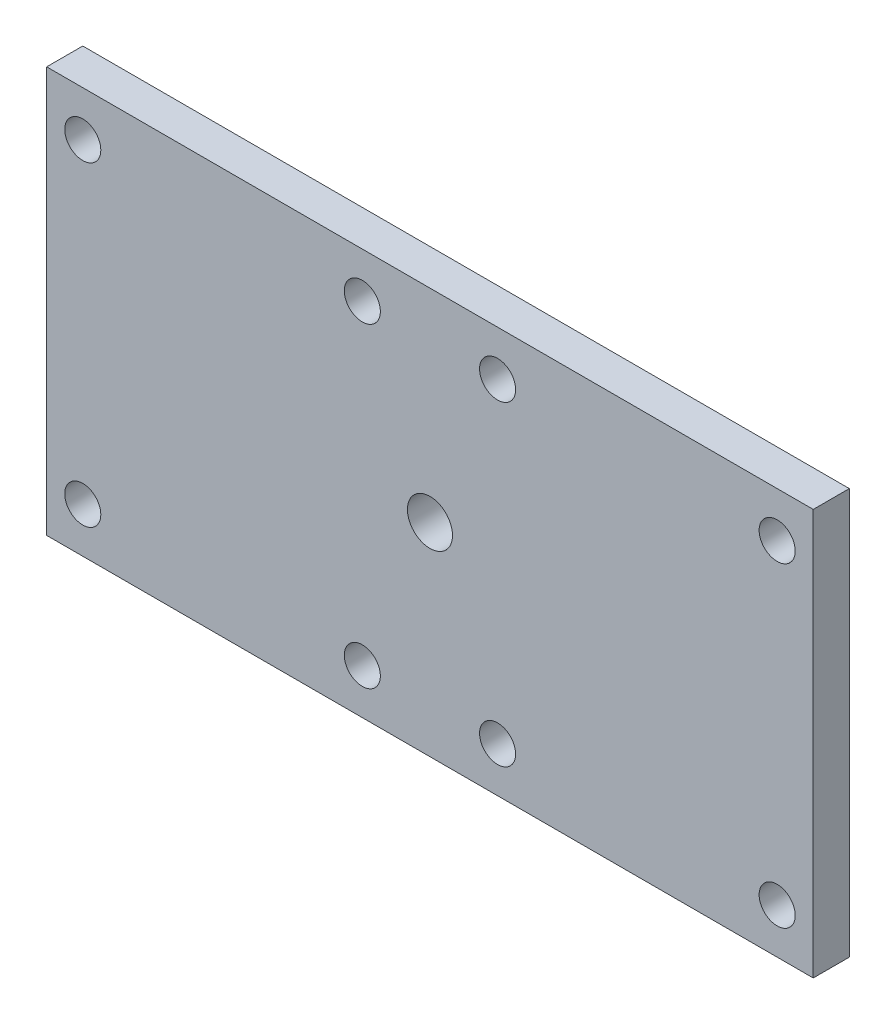
ISO-10303-21;
HEADER;
FILE_DESCRIPTION(('STEP AP214'),'2;1');
FILE_NAME('part.step','',(''),(''),'','','');
FILE_SCHEMA(('AUTOMOTIVE_DESIGN { 1 0 10303 214 1 1 1 1 }'));
ENDSEC;
DATA;
#1=APPLICATION_CONTEXT('core data for automotive mechanical design processes');
#2=APPLICATION_PROTOCOL_DEFINITION('international standard','automotive_design',2000,#1);
#3=PRODUCT_CONTEXT('',#1,'mechanical');
#4=PRODUCT('Part','Part','',(#3));
#5=PRODUCT_RELATED_PRODUCT_CATEGORY('part','',(#4));
#6=PRODUCT_DEFINITION_FORMATION('','',#4);
#7=PRODUCT_DEFINITION_CONTEXT('part definition',#1,'design');
#8=PRODUCT_DEFINITION('design','',#6,#7);
#9=PRODUCT_DEFINITION_SHAPE('','',#8);
#10=(LENGTH_UNIT() NAMED_UNIT(*) SI_UNIT(.MILLI.,.METRE.));
#11=(NAMED_UNIT(*) PLANE_ANGLE_UNIT() SI_UNIT($,.RADIAN.));
#12=(NAMED_UNIT(*) SI_UNIT($,.STERADIAN.) SOLID_ANGLE_UNIT());
#13=UNCERTAINTY_MEASURE_WITH_UNIT(LENGTH_MEASURE(1.E-05),#10,'distance_accuracy_value','');
#14=(GEOMETRIC_REPRESENTATION_CONTEXT(3) GLOBAL_UNCERTAINTY_ASSIGNED_CONTEXT((#13)) GLOBAL_UNIT_ASSIGNED_CONTEXT((#10,
#11,#12)) REPRESENTATION_CONTEXT('',''));
#15=CARTESIAN_POINT('',(0.,0.,0.));
#16=DIRECTION('',(0.,0.,1.));
#17=DIRECTION('',(1.,0.,0.));
#18=AXIS2_PLACEMENT_3D('',#15,#16,#17);
#19=CARTESIAN_POINT('',(0.,0.,5.));
#20=DIRECTION('',(-1.,0.,0.));
#21=DIRECTION('',(0.,-1.,0.));
#22=AXIS2_PLACEMENT_3D('',#19,#20,#21);
#23=PLANE('',#22);
#24=DIRECTION('',(0.,1.,0.));
#25=VECTOR('',#24,1.);
#26=CARTESIAN_POINT('',(0.,0.,4.));
#27=LINE('',#26,#25);
#28=CARTESIAN_POINT('',(0.,0.,4.));
#29=VERTEX_POINT('',#28);
#30=CARTESIAN_POINT('',(0.,44.9999999999999,4.));
#31=VERTEX_POINT('',#30);
#32=EDGE_CURVE('E80',#29,#31,#27,.T.);
#33=ORIENTED_EDGE('',*,*,#32,.F.);
#34=DIRECTION('',(0.,0.,-1.));
#35=VECTOR('',#34,1.);
#36=CARTESIAN_POINT('',(0.,0.,5.));
#37=LINE('',#36,#35);
#38=CARTESIAN_POINT('',(0.,0.,0.));
#39=VERTEX_POINT('',#38);
#40=EDGE_CURVE('E61',#29,#39,#37,.T.);
#41=ORIENTED_EDGE('',*,*,#40,.T.);
#42=DIRECTION('',(0.,1.,0.));
#43=VECTOR('',#42,1.);
#44=CARTESIAN_POINT('',(0.,0.,0.));
#45=LINE('',#44,#43);
#46=CARTESIAN_POINT('',(0.,44.9999999999999,0.));
#47=VERTEX_POINT('',#46);
#48=EDGE_CURVE('E126',#39,#47,#45,.T.);
#49=ORIENTED_EDGE('',*,*,#48,.T.);
#50=DIRECTION('',(0.,0.,-1.));
#51=VECTOR('',#50,1.);
#52=CARTESIAN_POINT('',(0.,44.9999999999999,5.));
#53=LINE('',#52,#51);
#54=EDGE_CURVE('E12',#31,#47,#53,.T.);
#55=ORIENTED_EDGE('',*,*,#54,.F.);
#56=EDGE_LOOP('',(#33,#41,#49,#55));
#57=FACE_BOUND('',#56,.T.);
#58=ADVANCED_FACE('F37',(#57),#23,.F.);
#59=CARTESIAN_POINT('',(0.,44.9999999999999,5.));
#60=DIRECTION('',(0.,-1.,0.));
#61=DIRECTION('',(1.,0.,0.));
#62=AXIS2_PLACEMENT_3D('',#59,#60,#61);
#63=PLANE('',#62);
#64=DIRECTION('',(-1.,0.,0.));
#65=VECTOR('',#64,1.);
#66=CARTESIAN_POINT('',(0.,44.9999999999999,4.));
#67=LINE('',#66,#65);
#68=CARTESIAN_POINT('',(-85.,44.9999999999999,4.));
#69=VERTEX_POINT('',#68);
#70=EDGE_CURVE('E86',#31,#69,#67,.T.);
#71=ORIENTED_EDGE('',*,*,#70,.F.);
#72=ORIENTED_EDGE('',*,*,#54,.T.);
#73=DIRECTION('',(-1.,0.,0.));
#74=VECTOR('',#73,1.);
#75=CARTESIAN_POINT('',(0.,44.9999999999999,0.));
#76=LINE('',#75,#74);
#77=CARTESIAN_POINT('',(-85.,44.9999999999999,0.));
#78=VERTEX_POINT('',#77);
#79=EDGE_CURVE('E129',#47,#78,#76,.T.);
#80=ORIENTED_EDGE('',*,*,#79,.T.);
#81=DIRECTION('',(0.,0.,-1.));
#82=VECTOR('',#81,1.);
#83=CARTESIAN_POINT('',(-85.,44.9999999999999,5.));
#84=LINE('',#83,#82);
#85=EDGE_CURVE('E45',#69,#78,#84,.T.);
#86=ORIENTED_EDGE('',*,*,#85,.F.);
#87=EDGE_LOOP('',(#71,#72,#80,#86));
#88=FACE_BOUND('',#87,.T.);
#89=ADVANCED_FACE('F144',(#88),#63,.F.);
#90=CARTESIAN_POINT('',(-85.,0.,5.));
#91=DIRECTION('',(1.,0.,0.));
#92=DIRECTION('',(0.,0.,-1.));
#93=AXIS2_PLACEMENT_3D('',#90,#91,#92);
#94=PLANE('',#93);
#95=DIRECTION('',(0.,-1.,0.));
#96=VECTOR('',#95,1.);
#97=CARTESIAN_POINT('',(-85.,44.9999999999999,4.));
#98=LINE('',#97,#96);
#99=CARTESIAN_POINT('',(-85.,0.,4.));
#100=VERTEX_POINT('',#99);
#101=EDGE_CURVE('E53',#69,#100,#98,.T.);
#102=ORIENTED_EDGE('',*,*,#101,.F.);
#103=ORIENTED_EDGE('',*,*,#85,.T.);
#104=DIRECTION('',(0.,-1.,0.));
#105=VECTOR('',#104,1.);
#106=CARTESIAN_POINT('',(-85.,0.,0.));
#107=LINE('',#106,#105);
#108=CARTESIAN_POINT('',(-85.,0.,0.));
#109=VERTEX_POINT('',#108);
#110=EDGE_CURVE('E95',#78,#109,#107,.T.);
#111=ORIENTED_EDGE('',*,*,#110,.T.);
#112=DIRECTION('',(0.,0.,-1.));
#113=VECTOR('',#112,1.);
#114=CARTESIAN_POINT('',(-85.,0.,5.));
#115=LINE('',#114,#113);
#116=EDGE_CURVE('E92',#100,#109,#115,.T.);
#117=ORIENTED_EDGE('',*,*,#116,.F.);
#118=EDGE_LOOP('',(#102,#103,#111,#117));
#119=FACE_BOUND('',#118,.T.);
#120=ADVANCED_FACE('F138',(#119),#94,.F.);
#121=CARTESIAN_POINT('',(0.,0.,5.));
#122=DIRECTION('',(0.,1.,0.));
#123=DIRECTION('',(-1.,0.,0.));
#124=AXIS2_PLACEMENT_3D('',#121,#122,#123);
#125=PLANE('',#124);
#126=DIRECTION('',(1.,0.,0.));
#127=VECTOR('',#126,1.);
#128=CARTESIAN_POINT('',(-85.,0.,4.));
#129=LINE('',#128,#127);
#130=EDGE_CURVE('E77',#100,#29,#129,.T.);
#131=ORIENTED_EDGE('',*,*,#130,.F.);
#132=ORIENTED_EDGE('',*,*,#116,.T.);
#133=DIRECTION('',(1.,0.,0.));
#134=VECTOR('',#133,1.);
#135=CARTESIAN_POINT('',(0.,0.,0.));
#136=LINE('',#135,#134);
#137=EDGE_CURVE('E90',#109,#39,#136,.T.);
#138=ORIENTED_EDGE('',*,*,#137,.T.);
#139=ORIENTED_EDGE('',*,*,#40,.F.);
#140=EDGE_LOOP('',(#131,#132,#138,#139));
#141=FACE_BOUND('',#140,.T.);
#142=ADVANCED_FACE('F88',(#141),#125,.F.);
#143=CARTESIAN_POINT('',(-81.,39.9999999999999,-5.));
#144=DIRECTION('',(0.,0.,1.));
#145=DIRECTION('',(1.,0.,0.));
#146=AXIS2_PLACEMENT_3D('',#143,#144,#145);
#147=CYLINDRICAL_SURFACE('',#146,2.);
#148=CARTESIAN_POINT('',(-81.,39.9999999999999,0.));
#149=DIRECTION('',(0.,0.,1.));
#150=DIRECTION('',(1.,0.,0.));
#151=AXIS2_PLACEMENT_3D('',#148,#149,#150);
#152=CIRCLE('',#151,2.);
#153=CARTESIAN_POINT('',(-79.,39.9999999999999,0.));
#154=VERTEX_POINT('',#153);
#155=EDGE_CURVE('E100',#154,#154,#152,.T.);
#156=ORIENTED_EDGE('',*,*,#155,.F.);
#157=EDGE_LOOP('',(#156));
#158=FACE_BOUND('',#157,.T.);
#159=CARTESIAN_POINT('',(-81.,39.9999999999999,4.));
#160=DIRECTION('',(0.,0.,1.));
#161=DIRECTION('',(1.,0.,0.));
#162=AXIS2_PLACEMENT_3D('',#159,#160,#161);
#163=CIRCLE('',#162,2.);
#164=CARTESIAN_POINT('',(-79.,39.9999999999999,4.));
#165=VERTEX_POINT('',#164);
#166=EDGE_CURVE('E104',#165,#165,#163,.F.);
#167=ORIENTED_EDGE('',*,*,#166,.F.);
#168=EDGE_LOOP('',(#167));
#169=FACE_BOUND('',#168,.T.);
#170=ADVANCED_FACE('F173',(#158,#169),#147,.F.);
#171=CARTESIAN_POINT('',(-35.,4.99999999999999,-5.));
#172=DIRECTION('',(0.,0.,1.));
#173=DIRECTION('',(1.,0.,0.));
#174=AXIS2_PLACEMENT_3D('',#171,#172,#173);
#175=CYLINDRICAL_SURFACE('',#174,2.);
#176=CARTESIAN_POINT('',(-35.,4.99999999999999,0.));
#177=DIRECTION('',(0.,0.,1.));
#178=DIRECTION('',(1.,0.,0.));
#179=AXIS2_PLACEMENT_3D('',#176,#177,#178);
#180=CIRCLE('',#179,2.);
#181=CARTESIAN_POINT('',(-33.,4.99999999999999,0.));
#182=VERTEX_POINT('',#181);
#183=EDGE_CURVE('E103',#182,#182,#180,.T.);
#184=ORIENTED_EDGE('',*,*,#183,.F.);
#185=EDGE_LOOP('',(#184));
#186=FACE_BOUND('',#185,.T.);
#187=CARTESIAN_POINT('',(-35.,4.99999999999999,4.));
#188=DIRECTION('',(0.,0.,1.));
#189=DIRECTION('',(1.,0.,0.));
#190=AXIS2_PLACEMENT_3D('',#187,#188,#189);
#191=CIRCLE('',#190,2.);
#192=CARTESIAN_POINT('',(-33.,4.99999999999999,4.));
#193=VERTEX_POINT('',#192);
#194=EDGE_CURVE('E165',#193,#193,#191,.F.);
#195=ORIENTED_EDGE('',*,*,#194,.F.);
#196=EDGE_LOOP('',(#195));
#197=FACE_BOUND('',#196,.T.);
#198=ADVANCED_FACE('F175',(#186,#197),#175,.F.);
#199=CARTESIAN_POINT('',(-35.,39.9999999999999,-5.));
#200=DIRECTION('',(0.,0.,1.));
#201=DIRECTION('',(1.,0.,0.));
#202=AXIS2_PLACEMENT_3D('',#199,#200,#201);
#203=CYLINDRICAL_SURFACE('',#202,2.);
#204=CARTESIAN_POINT('',(-35.,39.9999999999999,0.));
#205=DIRECTION('',(0.,0.,1.));
#206=DIRECTION('',(1.,0.,0.));
#207=AXIS2_PLACEMENT_3D('',#204,#205,#206);
#208=CIRCLE('',#207,2.);
#209=CARTESIAN_POINT('',(-33.,39.9999999999999,0.));
#210=VERTEX_POINT('',#209);
#211=EDGE_CURVE('E107',#210,#210,#208,.T.);
#212=ORIENTED_EDGE('',*,*,#211,.F.);
#213=EDGE_LOOP('',(#212));
#214=FACE_BOUND('',#213,.T.);
#215=CARTESIAN_POINT('',(-35.,39.9999999999999,4.));
#216=DIRECTION('',(0.,0.,1.));
#217=DIRECTION('',(1.,0.,0.));
#218=AXIS2_PLACEMENT_3D('',#215,#216,#217);
#219=CIRCLE('',#218,2.);
#220=CARTESIAN_POINT('',(-33.,39.9999999999999,4.));
#221=VERTEX_POINT('',#220);
#222=EDGE_CURVE('E163',#221,#221,#219,.F.);
#223=ORIENTED_EDGE('',*,*,#222,.F.);
#224=EDGE_LOOP('',(#223));
#225=FACE_BOUND('',#224,.T.);
#226=ADVANCED_FACE('F182',(#214,#225),#203,.F.);
#227=CARTESIAN_POINT('',(-3.99999999999999,39.9999999999999,-5.));
#228=DIRECTION('',(0.,0.,1.));
#229=DIRECTION('',(1.,0.,0.));
#230=AXIS2_PLACEMENT_3D('',#227,#228,#229);
#231=CYLINDRICAL_SURFACE('',#230,2.);
#232=CARTESIAN_POINT('',(-3.99999999999999,39.9999999999999,0.));
#233=DIRECTION('',(0.,0.,1.));
#234=DIRECTION('',(1.,0.,0.));
#235=AXIS2_PLACEMENT_3D('',#232,#233,#234);
#236=CIRCLE('',#235,2.);
#237=CARTESIAN_POINT('',(-1.99999999999999,39.9999999999999,0.));
#238=VERTEX_POINT('',#237);
#239=EDGE_CURVE('E110',#238,#238,#236,.T.);
#240=ORIENTED_EDGE('',*,*,#239,.F.);
#241=EDGE_LOOP('',(#240));
#242=FACE_BOUND('',#241,.T.);
#243=CARTESIAN_POINT('',(-3.99999999999999,39.9999999999999,4.));
#244=DIRECTION('',(0.,0.,1.));
#245=DIRECTION('',(1.,0.,0.));
#246=AXIS2_PLACEMENT_3D('',#243,#244,#245);
#247=CIRCLE('',#246,2.);
#248=CARTESIAN_POINT('',(-1.99999999999999,39.9999999999999,4.));
#249=VERTEX_POINT('',#248);
#250=EDGE_CURVE('E160',#249,#249,#247,.F.);
#251=ORIENTED_EDGE('',*,*,#250,.F.);
#252=EDGE_LOOP('',(#251));
#253=FACE_BOUND('',#252,.T.);
#254=ADVANCED_FACE('F226',(#242,#253),#231,.F.);
#255=CARTESIAN_POINT('',(-42.5,22.4999999999999,-5.));
#256=DIRECTION('',(0.,0.,1.));
#257=DIRECTION('',(1.,0.,0.));
#258=AXIS2_PLACEMENT_3D('',#255,#256,#257);
#259=CYLINDRICAL_SURFACE('',#258,2.5);
#260=CARTESIAN_POINT('',(-42.5,22.4999999999999,0.));
#261=DIRECTION('',(0.,0.,1.));
#262=DIRECTION('',(1.,0.,0.));
#263=AXIS2_PLACEMENT_3D('',#260,#261,#262);
#264=CIRCLE('',#263,2.5);
#265=CARTESIAN_POINT('',(-40.,22.4999999999999,0.));
#266=VERTEX_POINT('',#265);
#267=EDGE_CURVE('E113',#266,#266,#264,.T.);
#268=ORIENTED_EDGE('',*,*,#267,.F.);
#269=EDGE_LOOP('',(#268));
#270=FACE_BOUND('',#269,.T.);
#271=CARTESIAN_POINT('',(-42.5,22.4999999999999,4.));
#272=DIRECTION('',(0.,0.,1.));
#273=DIRECTION('',(1.,0.,0.));
#274=AXIS2_PLACEMENT_3D('',#271,#272,#273);
#275=CIRCLE('',#274,2.5);
#276=CARTESIAN_POINT('',(-40.,22.4999999999999,4.));
#277=VERTEX_POINT('',#276);
#278=EDGE_CURVE('E157',#277,#277,#275,.F.);
#279=ORIENTED_EDGE('',*,*,#278,.F.);
#280=EDGE_LOOP('',(#279));
#281=FACE_BOUND('',#280,.T.);
#282=ADVANCED_FACE('F233',(#270,#281),#259,.F.);
#283=CARTESIAN_POINT('',(-81.,4.99999999999995,-5.));
#284=DIRECTION('',(0.,0.,1.));
#285=DIRECTION('',(1.,0.,0.));
#286=AXIS2_PLACEMENT_3D('',#283,#284,#285);
#287=CYLINDRICAL_SURFACE('',#286,2.);
#288=CARTESIAN_POINT('',(-81.,4.99999999999995,0.));
#289=DIRECTION('',(0.,0.,1.));
#290=DIRECTION('',(1.,0.,0.));
#291=AXIS2_PLACEMENT_3D('',#288,#289,#290);
#292=CIRCLE('',#291,2.);
#293=CARTESIAN_POINT('',(-79.,4.99999999999995,0.));
#294=VERTEX_POINT('',#293);
#295=EDGE_CURVE('E116',#294,#294,#292,.T.);
#296=ORIENTED_EDGE('',*,*,#295,.F.);
#297=EDGE_LOOP('',(#296));
#298=FACE_BOUND('',#297,.T.);
#299=CARTESIAN_POINT('',(-81.,4.99999999999995,4.));
#300=DIRECTION('',(0.,0.,1.));
#301=DIRECTION('',(1.,0.,0.));
#302=AXIS2_PLACEMENT_3D('',#299,#300,#301);
#303=CIRCLE('',#302,2.);
#304=CARTESIAN_POINT('',(-79.,4.99999999999995,4.));
#305=VERTEX_POINT('',#304);
#306=EDGE_CURVE('E154',#305,#305,#303,.F.);
#307=ORIENTED_EDGE('',*,*,#306,.F.);
#308=EDGE_LOOP('',(#307));
#309=FACE_BOUND('',#308,.T.);
#310=ADVANCED_FACE('F242',(#298,#309),#287,.F.);
#311=CARTESIAN_POINT('',(-50.,4.99999999999996,-5.));
#312=DIRECTION('',(0.,0.,1.));
#313=DIRECTION('',(1.,0.,0.));
#314=AXIS2_PLACEMENT_3D('',#311,#312,#313);
#315=CYLINDRICAL_SURFACE('',#314,2.);
#316=CARTESIAN_POINT('',(-50.,4.99999999999996,0.));
#317=DIRECTION('',(0.,0.,1.));
#318=DIRECTION('',(1.,0.,0.));
#319=AXIS2_PLACEMENT_3D('',#316,#317,#318);
#320=CIRCLE('',#319,2.);
#321=CARTESIAN_POINT('',(-48.,4.99999999999996,0.));
#322=VERTEX_POINT('',#321);
#323=EDGE_CURVE('E119',#322,#322,#320,.T.);
#324=ORIENTED_EDGE('',*,*,#323,.F.);
#325=EDGE_LOOP('',(#324));
#326=FACE_BOUND('',#325,.T.);
#327=CARTESIAN_POINT('',(-50.,4.99999999999996,4.));
#328=DIRECTION('',(0.,0.,1.));
#329=DIRECTION('',(1.,0.,0.));
#330=AXIS2_PLACEMENT_3D('',#327,#328,#329);
#331=CIRCLE('',#330,2.);
#332=CARTESIAN_POINT('',(-48.,4.99999999999996,4.));
#333=VERTEX_POINT('',#332);
#334=EDGE_CURVE('E151',#333,#333,#331,.F.);
#335=ORIENTED_EDGE('',*,*,#334,.F.);
#336=EDGE_LOOP('',(#335));
#337=FACE_BOUND('',#336,.T.);
#338=ADVANCED_FACE('F239',(#326,#337),#315,.F.);
#339=CARTESIAN_POINT('',(-50.,39.9999999999999,-5.));
#340=DIRECTION('',(0.,0.,1.));
#341=DIRECTION('',(1.,0.,0.));
#342=AXIS2_PLACEMENT_3D('',#339,#340,#341);
#343=CYLINDRICAL_SURFACE('',#342,2.);
#344=CARTESIAN_POINT('',(-50.,39.9999999999999,0.));
#345=DIRECTION('',(0.,0.,1.));
#346=DIRECTION('',(1.,0.,0.));
#347=AXIS2_PLACEMENT_3D('',#344,#345,#346);
#348=CIRCLE('',#347,2.);
#349=CARTESIAN_POINT('',(-48.,39.9999999999999,0.));
#350=VERTEX_POINT('',#349);
#351=EDGE_CURVE('E122',#350,#350,#348,.T.);
#352=ORIENTED_EDGE('',*,*,#351,.F.);
#353=EDGE_LOOP('',(#352));
#354=FACE_BOUND('',#353,.T.);
#355=CARTESIAN_POINT('',(-50.,39.9999999999999,4.));
#356=DIRECTION('',(0.,0.,1.));
#357=DIRECTION('',(1.,0.,0.));
#358=AXIS2_PLACEMENT_3D('',#355,#356,#357);
#359=CIRCLE('',#358,2.);
#360=CARTESIAN_POINT('',(-48.,39.9999999999999,4.));
#361=VERTEX_POINT('',#360);
#362=EDGE_CURVE('E148',#361,#361,#359,.F.);
#363=ORIENTED_EDGE('',*,*,#362,.F.);
#364=EDGE_LOOP('',(#363));
#365=FACE_BOUND('',#364,.T.);
#366=ADVANCED_FACE('F204',(#354,#365),#343,.F.);
#367=CARTESIAN_POINT('',(-3.99999999999999,4.99999999999998,-5.));
#368=DIRECTION('',(0.,0.,1.));
#369=DIRECTION('',(1.,0.,0.));
#370=AXIS2_PLACEMENT_3D('',#367,#368,#369);
#371=CYLINDRICAL_SURFACE('',#370,2.);
#372=CARTESIAN_POINT('',(-3.99999999999999,4.99999999999998,0.));
#373=DIRECTION('',(0.,0.,1.));
#374=DIRECTION('',(1.,0.,0.));
#375=AXIS2_PLACEMENT_3D('',#372,#373,#374);
#376=CIRCLE('',#375,2.);
#377=CARTESIAN_POINT('',(-1.99999999999999,4.99999999999998,0.));
#378=VERTEX_POINT('',#377);
#379=EDGE_CURVE('E124',#378,#378,#376,.T.);
#380=ORIENTED_EDGE('',*,*,#379,.F.);
#381=EDGE_LOOP('',(#380));
#382=FACE_BOUND('',#381,.T.);
#383=CARTESIAN_POINT('',(-3.99999999999999,4.99999999999998,4.));
#384=DIRECTION('',(0.,0.,1.));
#385=DIRECTION('',(1.,0.,0.));
#386=AXIS2_PLACEMENT_3D('',#383,#384,#385);
#387=CIRCLE('',#386,2.);
#388=CARTESIAN_POINT('',(-1.99999999999999,4.99999999999998,4.));
#389=VERTEX_POINT('',#388);
#390=EDGE_CURVE('E40',#389,#389,#387,.F.);
#391=ORIENTED_EDGE('',*,*,#390,.F.);
#392=EDGE_LOOP('',(#391));
#393=FACE_BOUND('',#392,.T.);
#394=ADVANCED_FACE('F198',(#382,#393),#371,.F.);
#395=CARTESIAN_POINT('',(0.,0.,0.));
#396=DIRECTION('',(0.,0.,1.));
#397=DIRECTION('',(1.,0.,0.));
#398=AXIS2_PLACEMENT_3D('',#395,#396,#397);
#399=PLANE('',#398);
#400=ORIENTED_EDGE('',*,*,#379,.T.);
#401=EDGE_LOOP('',(#400));
#402=FACE_BOUND('',#401,.T.);
#403=ORIENTED_EDGE('',*,*,#351,.T.);
#404=EDGE_LOOP('',(#403));
#405=FACE_BOUND('',#404,.T.);
#406=ORIENTED_EDGE('',*,*,#323,.T.);
#407=EDGE_LOOP('',(#406));
#408=FACE_BOUND('',#407,.T.);
#409=ORIENTED_EDGE('',*,*,#295,.T.);
#410=EDGE_LOOP('',(#409));
#411=FACE_BOUND('',#410,.T.);
#412=ORIENTED_EDGE('',*,*,#267,.T.);
#413=EDGE_LOOP('',(#412));
#414=FACE_BOUND('',#413,.T.);
#415=ORIENTED_EDGE('',*,*,#239,.T.);
#416=EDGE_LOOP('',(#415));
#417=FACE_BOUND('',#416,.T.);
#418=ORIENTED_EDGE('',*,*,#211,.T.);
#419=EDGE_LOOP('',(#418));
#420=FACE_BOUND('',#419,.T.);
#421=ORIENTED_EDGE('',*,*,#183,.T.);
#422=EDGE_LOOP('',(#421));
#423=FACE_BOUND('',#422,.T.);
#424=ORIENTED_EDGE('',*,*,#155,.T.);
#425=EDGE_LOOP('',(#424));
#426=FACE_BOUND('',#425,.T.);
#427=ORIENTED_EDGE('',*,*,#48,.F.);
#428=ORIENTED_EDGE('',*,*,#137,.F.);
#429=ORIENTED_EDGE('',*,*,#110,.F.);
#430=ORIENTED_EDGE('',*,*,#79,.F.);
#431=EDGE_LOOP('',(#427,#428,#429,#430));
#432=FACE_BOUND('',#431,.T.);
#433=ADVANCED_FACE('F142',(#402,#405,#408,#411,#414,#417,#420,#423,#426,#432),#399,.F.);
#434=CARTESIAN_POINT('',(0.,0.,4.));
#435=DIRECTION('',(0.,0.,1.));
#436=DIRECTION('',(1.,0.,0.));
#437=AXIS2_PLACEMENT_3D('',#434,#435,#436);
#438=PLANE('',#437);
#439=ORIENTED_EDGE('',*,*,#130,.T.);
#440=ORIENTED_EDGE('',*,*,#32,.T.);
#441=ORIENTED_EDGE('',*,*,#70,.T.);
#442=ORIENTED_EDGE('',*,*,#101,.T.);
#443=EDGE_LOOP('',(#439,#440,#441,#442));
#444=FACE_BOUND('',#443,.T.);
#445=ORIENTED_EDGE('',*,*,#390,.T.);
#446=EDGE_LOOP('',(#445));
#447=FACE_BOUND('',#446,.T.);
#448=ORIENTED_EDGE('',*,*,#362,.T.);
#449=EDGE_LOOP('',(#448));
#450=FACE_BOUND('',#449,.T.);
#451=ORIENTED_EDGE('',*,*,#334,.T.);
#452=EDGE_LOOP('',(#451));
#453=FACE_BOUND('',#452,.T.);
#454=ORIENTED_EDGE('',*,*,#306,.T.);
#455=EDGE_LOOP('',(#454));
#456=FACE_BOUND('',#455,.T.);
#457=ORIENTED_EDGE('',*,*,#278,.T.);
#458=EDGE_LOOP('',(#457));
#459=FACE_BOUND('',#458,.T.);
#460=ORIENTED_EDGE('',*,*,#250,.T.);
#461=EDGE_LOOP('',(#460));
#462=FACE_BOUND('',#461,.T.);
#463=ORIENTED_EDGE('',*,*,#222,.T.);
#464=EDGE_LOOP('',(#463));
#465=FACE_BOUND('',#464,.T.);
#466=ORIENTED_EDGE('',*,*,#194,.T.);
#467=EDGE_LOOP('',(#466));
#468=FACE_BOUND('',#467,.T.);
#469=ORIENTED_EDGE('',*,*,#166,.T.);
#470=EDGE_LOOP('',(#469));
#471=FACE_BOUND('',#470,.T.);
#472=ADVANCED_FACE('F78',(#444,#447,#450,#453,#456,#459,#462,#465,#468,#471),#438,.T.);
#473=CLOSED_SHELL('',(#58,#89,#120,#142,#170,#198,#226,#254,#282,#310,#338,#366,#394,#433,#472));
#474=MANIFOLD_SOLID_BREP('B2',#473);
#475=ADVANCED_BREP_SHAPE_REPRESENTATION('',(#18,#474),#14);
#476=SHAPE_DEFINITION_REPRESENTATION(#9,#475);
ENDSEC;
END-ISO-10303-21;
